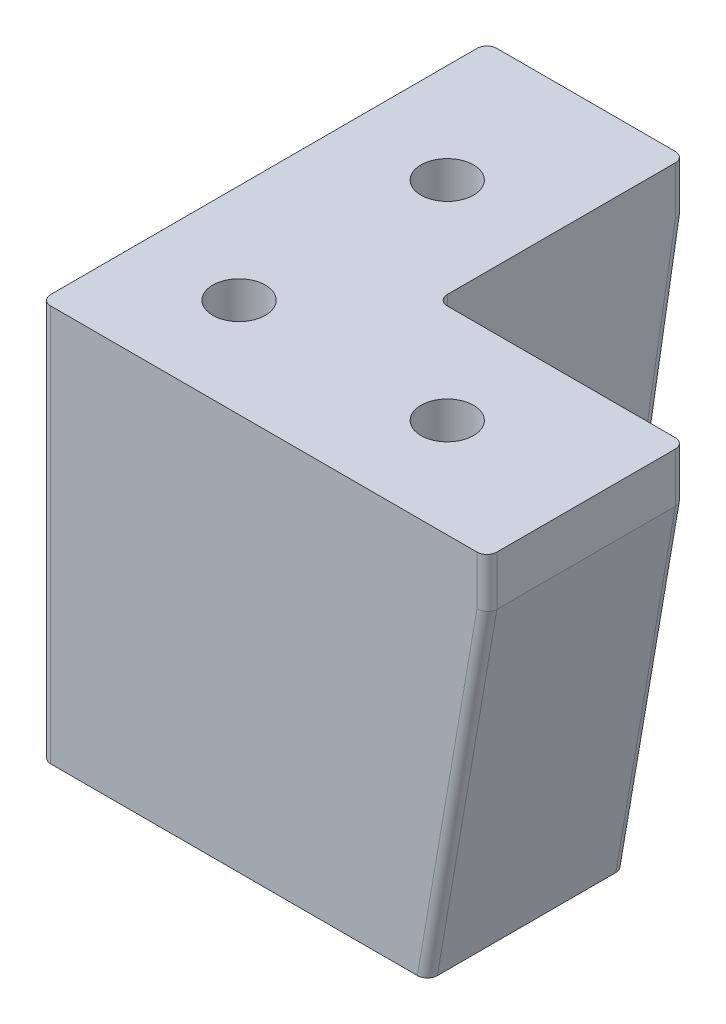
ISO-10303-21;
HEADER;
FILE_DESCRIPTION(('STEP AP214'),'2;1');
FILE_NAME('part.step','',(''),(''),'','','');
FILE_SCHEMA(('AUTOMOTIVE_DESIGN { 1 0 10303 214 1 1 1 1 }'));
ENDSEC;
DATA;
#1=APPLICATION_CONTEXT('core data for automotive mechanical design processes');
#2=APPLICATION_PROTOCOL_DEFINITION('international standard','automotive_design',2000,#1);
#3=PRODUCT_CONTEXT('',#1,'mechanical');
#4=PRODUCT('Part','Part','',(#3));
#5=PRODUCT_RELATED_PRODUCT_CATEGORY('part','',(#4));
#6=PRODUCT_DEFINITION_FORMATION('','',#4);
#7=PRODUCT_DEFINITION_CONTEXT('part definition',#1,'design');
#8=PRODUCT_DEFINITION('design','',#6,#7);
#9=PRODUCT_DEFINITION_SHAPE('','',#8);
#10=(LENGTH_UNIT() NAMED_UNIT(*) SI_UNIT(.MILLI.,.METRE.));
#11=(NAMED_UNIT(*) PLANE_ANGLE_UNIT() SI_UNIT($,.RADIAN.));
#12=(NAMED_UNIT(*) SI_UNIT($,.STERADIAN.) SOLID_ANGLE_UNIT());
#13=UNCERTAINTY_MEASURE_WITH_UNIT(LENGTH_MEASURE(1.E-05),#10,'distance_accuracy_value','');
#14=(GEOMETRIC_REPRESENTATION_CONTEXT(3) GLOBAL_UNCERTAINTY_ASSIGNED_CONTEXT((#13)) GLOBAL_UNIT_ASSIGNED_CONTEXT((#10,
#11,#12)) REPRESENTATION_CONTEXT('',''));
#15=CARTESIAN_POINT('',(0.,0.,0.));
#16=DIRECTION('',(0.,0.,1.));
#17=DIRECTION('',(1.,0.,0.));
#18=AXIS2_PLACEMENT_3D('',#15,#16,#17);
#19=CARTESIAN_POINT('',(31.,-5.,-10.));
#20=DIRECTION('',(0.,-1.,0.));
#21=DIRECTION('',(0.,0.,-1.));
#22=AXIS2_PLACEMENT_3D('',#19,#20,#21);
#23=PLANE('',#22);
#24=CARTESIAN_POINT('',(31.,-5.,-10.));
#25=DIRECTION('',(0.,-1.,0.));
#26=DIRECTION('',(0.,0.,-1.));
#27=AXIS2_PLACEMENT_3D('',#24,#25,#26);
#28=CIRCLE('',#27,5.);
#29=CARTESIAN_POINT('',(31.,-5.,-15.));
#30=VERTEX_POINT('',#29);
#31=EDGE_CURVE('E240',#30,#30,#28,.T.);
#32=ORIENTED_EDGE('',*,*,#31,.T.);
#33=EDGE_LOOP('',(#32));
#34=FACE_BOUND('',#33,.T.);
#35=CARTESIAN_POINT('',(31.,-5.,-10.));
#36=DIRECTION('',(0.,-1.,0.));
#37=DIRECTION('',(0.,0.,-1.));
#38=AXIS2_PLACEMENT_3D('',#35,#36,#37);
#39=CIRCLE('',#38,2.64999999999999);
#40=CARTESIAN_POINT('',(31.,-5.,-12.65));
#41=VERTEX_POINT('',#40);
#42=EDGE_CURVE('E274',#41,#41,#39,.F.);
#43=ORIENTED_EDGE('',*,*,#42,.T.);
#44=EDGE_LOOP('',(#43));
#45=FACE_BOUND('',#44,.T.);
#46=ADVANCED_FACE('F17',(#34,#45),#23,.T.);
#47=CARTESIAN_POINT('',(10.,-5.,-10.));
#48=DIRECTION('',(0.,-1.,0.));
#49=DIRECTION('',(0.,0.,-1.));
#50=AXIS2_PLACEMENT_3D('',#47,#48,#49);
#51=PLANE('',#50);
#52=CARTESIAN_POINT('',(10.,-5.,-10.));
#53=DIRECTION('',(0.,-1.,0.));
#54=DIRECTION('',(0.,0.,-1.));
#55=AXIS2_PLACEMENT_3D('',#52,#53,#54);
#56=CIRCLE('',#55,5.);
#57=CARTESIAN_POINT('',(10.,-5.,-15.));
#58=VERTEX_POINT('',#57);
#59=EDGE_CURVE('E267',#58,#58,#56,.T.);
#60=ORIENTED_EDGE('',*,*,#59,.T.);
#61=EDGE_LOOP('',(#60));
#62=FACE_BOUND('',#61,.T.);
#63=CARTESIAN_POINT('',(10.,-5.,-10.));
#64=DIRECTION('',(0.,-1.,0.));
#65=DIRECTION('',(0.,0.,-1.));
#66=AXIS2_PLACEMENT_3D('',#63,#64,#65);
#67=CIRCLE('',#66,2.64999999999999);
#68=CARTESIAN_POINT('',(10.,-5.,-12.65));
#69=VERTEX_POINT('',#68);
#70=EDGE_CURVE('E277',#69,#69,#67,.F.);
#71=ORIENTED_EDGE('',*,*,#70,.T.);
#72=EDGE_LOOP('',(#71));
#73=FACE_BOUND('',#72,.T.);
#74=ADVANCED_FACE('F592',(#62,#73),#51,.T.);
#75=CARTESIAN_POINT('',(10.,-5.,-31.));
#76=DIRECTION('',(0.,-1.,0.));
#77=DIRECTION('',(0.,0.,-1.));
#78=AXIS2_PLACEMENT_3D('',#75,#76,#77);
#79=PLANE('',#78);
#80=CARTESIAN_POINT('',(10.,-5.,-31.));
#81=DIRECTION('',(0.,-1.,0.));
#82=DIRECTION('',(0.,0.,-1.));
#83=AXIS2_PLACEMENT_3D('',#80,#81,#82);
#84=CIRCLE('',#83,5.);
#85=CARTESIAN_POINT('',(10.,-5.,-36.));
#86=VERTEX_POINT('',#85);
#87=EDGE_CURVE('E243',#86,#86,#84,.T.);
#88=ORIENTED_EDGE('',*,*,#87,.T.);
#89=EDGE_LOOP('',(#88));
#90=FACE_BOUND('',#89,.T.);
#91=CARTESIAN_POINT('',(10.,-5.,-31.));
#92=DIRECTION('',(0.,-1.,0.));
#93=DIRECTION('',(0.,0.,-1.));
#94=AXIS2_PLACEMENT_3D('',#91,#92,#93);
#95=CIRCLE('',#94,2.64999999999999);
#96=CARTESIAN_POINT('',(10.,-5.,-33.65));
#97=VERTEX_POINT('',#96);
#98=EDGE_CURVE('E234',#97,#97,#95,.F.);
#99=ORIENTED_EDGE('',*,*,#98,.T.);
#100=EDGE_LOOP('',(#99));
#101=FACE_BOUND('',#100,.T.);
#102=ADVANCED_FACE('F584',(#90,#101),#79,.T.);
#103=CARTESIAN_POINT('',(19.,-7.46783237838638,-43.5623555405872));
#104=DIRECTION('',(0.,-0.985622254813267,0.168963815110846));
#105=DIRECTION('',(0.,-0.168963815110846,-0.985622254813267));
#106=AXIS2_PLACEMENT_3D('',#103,#104,#105);
#107=CYLINDRICAL_SURFACE('',#106,1.);
#108=CARTESIAN_POINT('',(19.,-4.91490636514519,-44.));
#109=DIRECTION('',(0.,0.996399080392306,-0.0847872195166622));
#110=DIRECTION('',(0.,0.0847872195166613,0.996399080392306));
#111=AXIS2_PLACEMENT_3D('',#108,#109,#110);
#112=ELLIPSE('',#111,1.00361393309022,1.);
#113=CARTESIAN_POINT('',(20.,-4.91490636514526,-44.));
#114=VERTEX_POINT('',#113);
#115=CARTESIAN_POINT('',(19.,-5.00000000000005,-45.));
#116=VERTEX_POINT('',#115);
#117=EDGE_CURVE('E135',#114,#116,#112,.T.);
#118=ORIENTED_EDGE('',*,*,#117,.F.);
#119=DIRECTION('',(0.,0.985622254813267,-0.168963815110846));
#120=VECTOR('',#119,1.);
#121=CARTESIAN_POINT('',(20.,-40.,-37.9854125197392));
#122=LINE('',#121,#120);
#123=CARTESIAN_POINT('',(20.,-40.,-37.9854125197392));
#124=VERTEX_POINT('',#123);
#125=EDGE_CURVE('E133',#124,#114,#122,.T.);
#126=ORIENTED_EDGE('',*,*,#125,.F.);
#127=CARTESIAN_POINT('',(19.,-40.,-37.9854125197392));
#128=DIRECTION('',(0.,-1.,0.));
#129=DIRECTION('',(0.,0.,1.));
#130=AXIS2_PLACEMENT_3D('',#127,#128,#129);
#131=ELLIPSE('',#130,1.01458748026084,1.);
#132=CARTESIAN_POINT('',(19.,-40.,-39.));
#133=VERTEX_POINT('',#132);
#134=EDGE_CURVE('E20',#124,#133,#131,.F.);
#135=ORIENTED_EDGE('',*,*,#134,.T.);
#136=DIRECTION('',(0.,0.985622254813267,-0.168963815110846));
#137=VECTOR('',#136,1.);
#138=CARTESIAN_POINT('',(19.,-7.63679619349722,-44.5479777954005));
#139=LINE('',#138,#137);
#140=EDGE_CURVE('E130',#116,#133,#139,.F.);
#141=ORIENTED_EDGE('',*,*,#140,.F.);
#142=EDGE_LOOP('',(#118,#126,#135,#141));
#143=FACE_BOUND('',#142,.T.);
#144=ADVANCED_FACE('F129',(#143),#107,.T.);
#145=CARTESIAN_POINT('',(19.,-5.,-44.));
#146=DIRECTION('',(0.,1.,0.));
#147=DIRECTION('',(0.,0.,1.));
#148=AXIS2_PLACEMENT_3D('',#145,#146,#147);
#149=CYLINDRICAL_SURFACE('',#148,1.);
#150=CARTESIAN_POINT('',(19.,0.,-44.));
#151=DIRECTION('',(0.,1.,0.));
#152=DIRECTION('',(0.,0.,1.));
#153=AXIS2_PLACEMENT_3D('',#150,#151,#152);
#154=CIRCLE('',#153,1.);
#155=CARTESIAN_POINT('',(19.,0.,-45.));
#156=VERTEX_POINT('',#155);
#157=CARTESIAN_POINT('',(20.,0.,-44.));
#158=VERTEX_POINT('',#157);
#159=EDGE_CURVE('E297',#156,#158,#154,.F.);
#160=ORIENTED_EDGE('',*,*,#159,.T.);
#161=DIRECTION('',(0.,1.,0.));
#162=VECTOR('',#161,1.);
#163=CARTESIAN_POINT('',(20.,-5.,-44.));
#164=LINE('',#163,#162);
#165=EDGE_CURVE('E209',#114,#158,#164,.T.);
#166=ORIENTED_EDGE('',*,*,#165,.F.);
#167=ORIENTED_EDGE('',*,*,#117,.T.);
#168=DIRECTION('',(0.,1.,0.));
#169=VECTOR('',#168,1.);
#170=CARTESIAN_POINT('',(19.,-5.,-45.));
#171=LINE('',#170,#169);
#172=EDGE_CURVE('E230',#156,#116,#171,.F.);
#173=ORIENTED_EDGE('',*,*,#172,.F.);
#174=EDGE_LOOP('',(#160,#166,#167,#173));
#175=FACE_BOUND('',#174,.T.);
#176=ADVANCED_FACE('F301',(#175),#149,.T.);
#177=CARTESIAN_POINT('',(44.,-5.,-19.));
#178=DIRECTION('',(0.,1.,0.));
#179=DIRECTION('',(0.,0.,1.));
#180=AXIS2_PLACEMENT_3D('',#177,#178,#179);
#181=CYLINDRICAL_SURFACE('',#180,1.);
#182=CARTESIAN_POINT('',(44.,0.,-19.));
#183=DIRECTION('',(0.,1.,0.));
#184=DIRECTION('',(0.,0.,1.));
#185=AXIS2_PLACEMENT_3D('',#182,#183,#184);
#186=CIRCLE('',#185,1.);
#187=CARTESIAN_POINT('',(44.,0.,-20.));
#188=VERTEX_POINT('',#187);
#189=CARTESIAN_POINT('',(45.,0.,-19.));
#190=VERTEX_POINT('',#189);
#191=EDGE_CURVE('E295',#188,#190,#186,.F.);
#192=ORIENTED_EDGE('',*,*,#191,.T.);
#193=DIRECTION('',(0.,1.,0.));
#194=VECTOR('',#193,1.);
#195=CARTESIAN_POINT('',(45.,-5.,-19.));
#196=LINE('',#195,#194);
#197=CARTESIAN_POINT('',(45.,-5.00000000000007,-19.));
#198=VERTEX_POINT('',#197);
#199=EDGE_CURVE('E231',#198,#190,#196,.T.);
#200=ORIENTED_EDGE('',*,*,#199,.F.);
#201=CARTESIAN_POINT('',(44.,-4.91490636514523,-19.));
#202=DIRECTION('',(-0.0847872195166622,-0.996399080392306,0.));
#203=DIRECTION('',(-0.996399080392306,0.0847872195166613,0.));
#204=AXIS2_PLACEMENT_3D('',#201,#202,#203);
#205=ELLIPSE('',#204,1.00361393309022,1.);
#206=CARTESIAN_POINT('',(44.,-4.91490636514521,-20.));
#207=VERTEX_POINT('',#206);
#208=EDGE_CURVE('E290',#207,#198,#205,.T.);
#209=ORIENTED_EDGE('',*,*,#208,.F.);
#210=DIRECTION('',(0.,1.,0.));
#211=VECTOR('',#210,1.);
#212=CARTESIAN_POINT('',(44.,-5.,-20.));
#213=LINE('',#212,#211);
#214=EDGE_CURVE('E207',#188,#207,#213,.F.);
#215=ORIENTED_EDGE('',*,*,#214,.F.);
#216=EDGE_LOOP('',(#192,#200,#209,#215));
#217=FACE_BOUND('',#216,.T.);
#218=ADVANCED_FACE('F358',(#217),#181,.T.);
#219=CARTESIAN_POINT('',(44.0143777451868,-4.83103618488916,-19.));
#220=DIRECTION('',(-0.168963815110846,-0.985622254813267,0.));
#221=DIRECTION('',(0.985622254813267,-0.168963815110846,0.));
#222=AXIS2_PLACEMENT_3D('',#219,#220,#221);
#223=CYLINDRICAL_SURFACE('',#222,1.);
#224=ORIENTED_EDGE('',*,*,#208,.T.);
#225=DIRECTION('',(0.168963815110846,0.985622254813267,0.));
#226=VECTOR('',#225,1.);
#227=CARTESIAN_POINT('',(44.5479777954005,-7.63679619349722,-19.));
#228=LINE('',#227,#226);
#229=CARTESIAN_POINT('',(39.,-40.,-19.));
#230=VERTEX_POINT('',#229);
#231=EDGE_CURVE('E215',#230,#198,#228,.T.);
#232=ORIENTED_EDGE('',*,*,#231,.F.);
#233=CARTESIAN_POINT('',(37.9854125197392,-40.,-19.));
#234=DIRECTION('',(0.,-1.,0.));
#235=DIRECTION('',(-1.,0.,0.));
#236=AXIS2_PLACEMENT_3D('',#233,#234,#235);
#237=ELLIPSE('',#236,1.01458748026084,1.);
#238=CARTESIAN_POINT('',(37.9854125197392,-40.,-20.));
#239=VERTEX_POINT('',#238);
#240=EDGE_CURVE('E293',#230,#239,#237,.F.);
#241=ORIENTED_EDGE('',*,*,#240,.T.);
#242=DIRECTION('',(-0.168963815110846,-0.985622254813267,0.));
#243=VECTOR('',#242,1.);
#244=CARTESIAN_POINT('',(44.,-4.9149063651452,-20.));
#245=LINE('',#244,#243);
#246=EDGE_CURVE('E204',#207,#239,#245,.T.);
#247=ORIENTED_EDGE('',*,*,#246,.F.);
#248=EDGE_LOOP('',(#224,#232,#241,#247));
#249=FACE_BOUND('',#248,.T.);
#250=ADVANCED_FACE('F325',(#249),#223,.T.);
#251=CARTESIAN_POINT('',(21.,-5.,-21.));
#252=DIRECTION('',(0.,-1.,0.));
#253=DIRECTION('',(0.,0.,-1.));
#254=AXIS2_PLACEMENT_3D('',#251,#252,#253);
#255=CYLINDRICAL_SURFACE('',#254,1.);
#256=DIRECTION('',(0.,1.,0.));
#257=VECTOR('',#256,1.);
#258=CARTESIAN_POINT('',(20.,-5.,-21.));
#259=LINE('',#258,#257);
#260=CARTESIAN_POINT('',(20.,0.,-21.));
#261=VERTEX_POINT('',#260);
#262=CARTESIAN_POINT('',(20.,-40.,-21.));
#263=VERTEX_POINT('',#262);
#264=EDGE_CURVE('E143',#261,#263,#259,.F.);
#265=ORIENTED_EDGE('',*,*,#264,.F.);
#266=CARTESIAN_POINT('',(21.,0.,-21.));
#267=DIRECTION('',(0.,-1.,0.));
#268=DIRECTION('',(0.,0.,-1.));
#269=AXIS2_PLACEMENT_3D('',#266,#267,#268);
#270=CIRCLE('',#269,1.);
#271=CARTESIAN_POINT('',(21.,0.,-20.));
#272=VERTEX_POINT('',#271);
#273=EDGE_CURVE('E288',#272,#261,#270,.T.);
#274=ORIENTED_EDGE('',*,*,#273,.F.);
#275=DIRECTION('',(0.,1.,0.));
#276=VECTOR('',#275,1.);
#277=CARTESIAN_POINT('',(21.,-5.,-20.));
#278=LINE('',#277,#276);
#279=CARTESIAN_POINT('',(21.,-40.,-20.));
#280=VERTEX_POINT('',#279);
#281=EDGE_CURVE('E200',#280,#272,#278,.T.);
#282=ORIENTED_EDGE('',*,*,#281,.F.);
#283=CARTESIAN_POINT('',(21.,-40.,-21.));
#284=DIRECTION('',(0.,-1.,0.));
#285=DIRECTION('',(0.,0.,-1.));
#286=AXIS2_PLACEMENT_3D('',#283,#284,#285);
#287=CIRCLE('',#286,1.);
#288=EDGE_CURVE('E286',#263,#280,#287,.F.);
#289=ORIENTED_EDGE('',*,*,#288,.F.);
#290=EDGE_LOOP('',(#265,#274,#282,#289));
#291=FACE_BOUND('',#290,.T.);
#292=ADVANCED_FACE('F318',(#291),#255,.F.);
#293=CARTESIAN_POINT('',(43.5623555405872,-7.46783237838638,-1.));
#294=DIRECTION('',(-0.168963815110846,-0.985622254813267,0.));
#295=DIRECTION('',(0.985622254813267,-0.168963815110846,0.));
#296=AXIS2_PLACEMENT_3D('',#293,#294,#295);
#297=CYLINDRICAL_SURFACE('',#296,1.);
#298=CARTESIAN_POINT('',(44.,-4.91490636514519,-1.));
#299=DIRECTION('',(0.0847872195166622,0.996399080392306,0.));
#300=DIRECTION('',(-0.996399080392306,0.0847872195166613,0.));
#301=AXIS2_PLACEMENT_3D('',#298,#299,#300);
#302=ELLIPSE('',#301,1.00361393309022,1.);
#303=CARTESIAN_POINT('',(44.,-4.91490636514526,0.));
#304=VERTEX_POINT('',#303);
#305=CARTESIAN_POINT('',(45.,-5.00000000000005,-1.));
#306=VERTEX_POINT('',#305);
#307=EDGE_CURVE('E282',#304,#306,#302,.T.);
#308=ORIENTED_EDGE('',*,*,#307,.F.);
#309=DIRECTION('',(0.168963815110846,0.985622254813267,0.));
#310=VECTOR('',#309,1.);
#311=CARTESIAN_POINT('',(37.9854125197392,-40.,0.));
#312=LINE('',#311,#310);
#313=CARTESIAN_POINT('',(37.9854125197392,-40.,0.));
#314=VERTEX_POINT('',#313);
#315=EDGE_CURVE('E203',#314,#304,#312,.T.);
#316=ORIENTED_EDGE('',*,*,#315,.F.);
#317=CARTESIAN_POINT('',(37.9854125197392,-40.,-1.));
#318=DIRECTION('',(0.,-1.,0.));
#319=DIRECTION('',(-1.,0.,0.));
#320=AXIS2_PLACEMENT_3D('',#317,#318,#319);
#321=ELLIPSE('',#320,1.01458748026084,1.);
#322=CARTESIAN_POINT('',(39.,-40.,-1.));
#323=VERTEX_POINT('',#322);
#324=EDGE_CURVE('E284',#314,#323,#321,.F.);
#325=ORIENTED_EDGE('',*,*,#324,.T.);
#326=DIRECTION('',(0.168963815110846,0.985622254813267,0.));
#327=VECTOR('',#326,1.);
#328=CARTESIAN_POINT('',(44.5479777954005,-7.63679619349722,-1.));
#329=LINE('',#328,#327);
#330=EDGE_CURVE('E218',#306,#323,#329,.F.);
#331=ORIENTED_EDGE('',*,*,#330,.F.);
#332=EDGE_LOOP('',(#308,#316,#325,#331));
#333=FACE_BOUND('',#332,.T.);
#334=ADVANCED_FACE('F334',(#333),#297,.T.);
#335=CARTESIAN_POINT('',(44.,-5.,-1.));
#336=DIRECTION('',(0.,1.,0.));
#337=DIRECTION('',(0.,0.,1.));
#338=AXIS2_PLACEMENT_3D('',#335,#336,#337);
#339=CYLINDRICAL_SURFACE('',#338,1.);
#340=CARTESIAN_POINT('',(44.,0.,-1.));
#341=DIRECTION('',(0.,1.,0.));
#342=DIRECTION('',(0.,0.,1.));
#343=AXIS2_PLACEMENT_3D('',#340,#341,#342);
#344=CIRCLE('',#343,1.);
#345=CARTESIAN_POINT('',(45.,0.,-1.));
#346=VERTEX_POINT('',#345);
#347=CARTESIAN_POINT('',(44.,0.,0.));
#348=VERTEX_POINT('',#347);
#349=EDGE_CURVE('E280',#346,#348,#344,.F.);
#350=ORIENTED_EDGE('',*,*,#349,.T.);
#351=DIRECTION('',(0.,1.,0.));
#352=VECTOR('',#351,1.);
#353=CARTESIAN_POINT('',(44.,-5.,0.));
#354=LINE('',#353,#352);
#355=EDGE_CURVE('E214',#304,#348,#354,.T.);
#356=ORIENTED_EDGE('',*,*,#355,.F.);
#357=ORIENTED_EDGE('',*,*,#307,.T.);
#358=DIRECTION('',(0.,1.,0.));
#359=VECTOR('',#358,1.);
#360=CARTESIAN_POINT('',(45.,-5.,-1.));
#361=LINE('',#360,#359);
#362=EDGE_CURVE('E227',#346,#306,#361,.F.);
#363=ORIENTED_EDGE('',*,*,#362,.F.);
#364=EDGE_LOOP('',(#350,#356,#357,#363));
#365=FACE_BOUND('',#364,.T.);
#366=ADVANCED_FACE('F354',(#365),#339,.T.);
#367=CARTESIAN_POINT('',(10.,-5.,-10.));
#368=DIRECTION('',(0.,-1.,0.));
#369=DIRECTION('',(0.,0.,-1.));
#370=AXIS2_PLACEMENT_3D('',#367,#368,#369);
#371=CYLINDRICAL_SURFACE('',#370,2.64999999999999);
#372=CARTESIAN_POINT('',(10.,0.,-10.));
#373=DIRECTION('',(0.,-1.,0.));
#374=DIRECTION('',(0.,0.,-1.));
#375=AXIS2_PLACEMENT_3D('',#372,#373,#374);
#376=CIRCLE('',#375,2.64999999999999);
#377=CARTESIAN_POINT('',(10.,0.,-12.65));
#378=VERTEX_POINT('',#377);
#379=EDGE_CURVE('E237',#378,#378,#376,.T.);
#380=ORIENTED_EDGE('',*,*,#379,.F.);
#381=EDGE_LOOP('',(#380));
#382=FACE_BOUND('',#381,.T.);
#383=ORIENTED_EDGE('',*,*,#70,.F.);
#384=EDGE_LOOP('',(#383));
#385=FACE_BOUND('',#384,.T.);
#386=ADVANCED_FACE('F416',(#382,#385),#371,.F.);
#387=CARTESIAN_POINT('',(31.,-5.,-10.));
#388=DIRECTION('',(0.,-1.,0.));
#389=DIRECTION('',(0.,0.,-1.));
#390=AXIS2_PLACEMENT_3D('',#387,#388,#389);
#391=CYLINDRICAL_SURFACE('',#390,2.64999999999999);
#392=CARTESIAN_POINT('',(31.,0.,-10.));
#393=DIRECTION('',(0.,-1.,0.));
#394=DIRECTION('',(0.,0.,-1.));
#395=AXIS2_PLACEMENT_3D('',#392,#393,#394);
#396=CIRCLE('',#395,2.64999999999999);
#397=CARTESIAN_POINT('',(31.,0.,-12.65));
#398=VERTEX_POINT('',#397);
#399=EDGE_CURVE('E260',#398,#398,#396,.T.);
#400=ORIENTED_EDGE('',*,*,#399,.F.);
#401=EDGE_LOOP('',(#400));
#402=FACE_BOUND('',#401,.T.);
#403=ORIENTED_EDGE('',*,*,#42,.F.);
#404=EDGE_LOOP('',(#403));
#405=FACE_BOUND('',#404,.T.);
#406=ADVANCED_FACE('F412',(#402,#405),#391,.F.);
#407=CARTESIAN_POINT('',(10.,-5.,-31.));
#408=DIRECTION('',(0.,-1.,0.));
#409=DIRECTION('',(0.,0.,-1.));
#410=AXIS2_PLACEMENT_3D('',#407,#408,#409);
#411=CYLINDRICAL_SURFACE('',#410,2.64999999999999);
#412=CARTESIAN_POINT('',(10.,0.,-31.));
#413=DIRECTION('',(0.,-1.,0.));
#414=DIRECTION('',(0.,0.,-1.));
#415=AXIS2_PLACEMENT_3D('',#412,#413,#414);
#416=CIRCLE('',#415,2.64999999999999);
#417=CARTESIAN_POINT('',(10.,0.,-33.65));
#418=VERTEX_POINT('',#417);
#419=EDGE_CURVE('E196',#418,#418,#416,.T.);
#420=ORIENTED_EDGE('',*,*,#419,.F.);
#421=EDGE_LOOP('',(#420));
#422=FACE_BOUND('',#421,.T.);
#423=ORIENTED_EDGE('',*,*,#98,.F.);
#424=EDGE_LOOP('',(#423));
#425=FACE_BOUND('',#424,.T.);
#426=ADVANCED_FACE('F409',(#422,#425),#411,.F.);
#427=CARTESIAN_POINT('',(45.,-5.,0.));
#428=DIRECTION('',(1.,0.,0.));
#429=DIRECTION('',(0.,0.,-1.));
#430=AXIS2_PLACEMENT_3D('',#427,#428,#429);
#431=PLANE('',#430);
#432=DIRECTION('',(0.,0.,1.));
#433=VECTOR('',#432,1.);
#434=CARTESIAN_POINT('',(45.,0.,0.));
#435=LINE('',#434,#433);
#436=EDGE_CURVE('E188',#346,#190,#435,.F.);
#437=ORIENTED_EDGE('',*,*,#436,.F.);
#438=ORIENTED_EDGE('',*,*,#362,.T.);
#439=DIRECTION('',(0.,0.,1.));
#440=VECTOR('',#439,1.);
#441=CARTESIAN_POINT('',(45.,-5.,0.));
#442=LINE('',#441,#440);
#443=EDGE_CURVE('E221',#198,#306,#442,.T.);
#444=ORIENTED_EDGE('',*,*,#443,.F.);
#445=ORIENTED_EDGE('',*,*,#199,.T.);
#446=EDGE_LOOP('',(#437,#438,#444,#445));
#447=FACE_BOUND('',#446,.T.);
#448=ADVANCED_FACE('F356',(#447),#431,.T.);
#449=CARTESIAN_POINT('',(20.,-5.,-45.));
#450=DIRECTION('',(0.,0.,-1.));
#451=DIRECTION('',(-1.,0.,0.));
#452=AXIS2_PLACEMENT_3D('',#449,#450,#451);
#453=PLANE('',#452);
#454=DIRECTION('',(1.,0.,0.));
#455=VECTOR('',#454,1.);
#456=CARTESIAN_POINT('',(0.,0.,-45.));
#457=LINE('',#456,#455);
#458=CARTESIAN_POINT('',(1.,0.,-45.));
#459=VERTEX_POINT('',#458);
#460=EDGE_CURVE('E194',#156,#459,#457,.F.);
#461=ORIENTED_EDGE('',*,*,#460,.F.);
#462=ORIENTED_EDGE('',*,*,#172,.T.);
#463=DIRECTION('',(1.,0.,0.));
#464=VECTOR('',#463,1.);
#465=CARTESIAN_POINT('',(0.,-5.,-45.));
#466=LINE('',#465,#464);
#467=CARTESIAN_POINT('',(1.,-5.00000000000007,-45.));
#468=VERTEX_POINT('',#467);
#469=EDGE_CURVE('E142',#468,#116,#466,.T.);
#470=ORIENTED_EDGE('',*,*,#469,.F.);
#471=DIRECTION('',(0.,1.,0.));
#472=VECTOR('',#471,1.);
#473=CARTESIAN_POINT('',(1.,-5.,-45.));
#474=LINE('',#473,#472);
#475=EDGE_CURVE('E175',#459,#468,#474,.F.);
#476=ORIENTED_EDGE('',*,*,#475,.F.);
#477=EDGE_LOOP('',(#461,#462,#470,#476));
#478=FACE_BOUND('',#477,.T.);
#479=ADVANCED_FACE('F304',(#478),#453,.T.);
#480=CARTESIAN_POINT('',(31.,-5.,-10.));
#481=DIRECTION('',(0.,-1.,0.));
#482=DIRECTION('',(0.,0.,-1.));
#483=AXIS2_PLACEMENT_3D('',#480,#481,#482);
#484=CYLINDRICAL_SURFACE('',#483,5.);
#485=CARTESIAN_POINT('',(31.,-40.,-10.));
#486=DIRECTION('',(0.,-1.,0.));
#487=DIRECTION('',(0.,0.,-1.));
#488=AXIS2_PLACEMENT_3D('',#485,#486,#487);
#489=CIRCLE('',#488,5.);
#490=CARTESIAN_POINT('',(31.,-40.,-15.));
#491=VERTEX_POINT('',#490);
#492=EDGE_CURVE('E170',#491,#491,#489,.F.);
#493=ORIENTED_EDGE('',*,*,#492,.F.);
#494=EDGE_LOOP('',(#493));
#495=FACE_BOUND('',#494,.T.);
#496=ORIENTED_EDGE('',*,*,#31,.F.);
#497=EDGE_LOOP('',(#496));
#498=FACE_BOUND('',#497,.T.);
#499=ADVANCED_FACE('F400',(#495,#498),#484,.F.);
#500=CARTESIAN_POINT('',(10.,-5.,-10.));
#501=DIRECTION('',(0.,-1.,0.));
#502=DIRECTION('',(0.,0.,-1.));
#503=AXIS2_PLACEMENT_3D('',#500,#501,#502);
#504=CYLINDRICAL_SURFACE('',#503,5.);
#505=CARTESIAN_POINT('',(10.,-40.,-10.));
#506=DIRECTION('',(0.,-1.,0.));
#507=DIRECTION('',(0.,0.,-1.));
#508=AXIS2_PLACEMENT_3D('',#505,#506,#507);
#509=CIRCLE('',#508,5.);
#510=CARTESIAN_POINT('',(10.,-40.,-15.));
#511=VERTEX_POINT('',#510);
#512=EDGE_CURVE('E249',#511,#511,#509,.F.);
#513=ORIENTED_EDGE('',*,*,#512,.F.);
#514=EDGE_LOOP('',(#513));
#515=FACE_BOUND('',#514,.T.);
#516=ORIENTED_EDGE('',*,*,#59,.F.);
#517=EDGE_LOOP('',(#516));
#518=FACE_BOUND('',#517,.T.);
#519=ADVANCED_FACE('F396',(#515,#518),#504,.F.);
#520=CARTESIAN_POINT('',(10.,-5.,-31.));
#521=DIRECTION('',(0.,-1.,0.));
#522=DIRECTION('',(0.,0.,-1.));
#523=AXIS2_PLACEMENT_3D('',#520,#521,#522);
#524=CYLINDRICAL_SURFACE('',#523,5.);
#525=CARTESIAN_POINT('',(10.,-40.,-31.));
#526=DIRECTION('',(0.,-1.,0.));
#527=DIRECTION('',(0.,0.,-1.));
#528=AXIS2_PLACEMENT_3D('',#525,#526,#527);
#529=CIRCLE('',#528,5.);
#530=CARTESIAN_POINT('',(10.,-40.,-36.));
#531=VERTEX_POINT('',#530);
#532=EDGE_CURVE('E161',#531,#531,#529,.F.);
#533=ORIENTED_EDGE('',*,*,#532,.F.);
#534=EDGE_LOOP('',(#533));
#535=FACE_BOUND('',#534,.T.);
#536=ORIENTED_EDGE('',*,*,#87,.F.);
#537=EDGE_LOOP('',(#536));
#538=FACE_BOUND('',#537,.T.);
#539=ADVANCED_FACE('F393',(#535,#538),#524,.F.);
#540=CARTESIAN_POINT('',(44.5479777954005,-7.63679619349722,0.));
#541=DIRECTION('',(0.985622254813267,-0.168963815110846,0.));
#542=DIRECTION('',(0.168963815110846,0.985622254813267,0.));
#543=AXIS2_PLACEMENT_3D('',#540,#541,#542);
#544=PLANE('',#543);
#545=DIRECTION('',(0.,0.,-1.));
#546=VECTOR('',#545,1.);
#547=CARTESIAN_POINT('',(39.,-40.,0.));
#548=LINE('',#547,#546);
#549=EDGE_CURVE('E158',#230,#323,#548,.F.);
#550=ORIENTED_EDGE('',*,*,#549,.F.);
#551=ORIENTED_EDGE('',*,*,#231,.T.);
#552=ORIENTED_EDGE('',*,*,#443,.T.);
#553=ORIENTED_EDGE('',*,*,#330,.T.);
#554=EDGE_LOOP('',(#550,#551,#552,#553));
#555=FACE_BOUND('',#554,.T.);
#556=ADVANCED_FACE('F330',(#555),#544,.T.);
#557=CARTESIAN_POINT('',(0.,-7.63679619349722,-44.5479777954005));
#558=DIRECTION('',(0.,-0.168963815110846,-0.985622254813267));
#559=DIRECTION('',(0.,0.985622254813267,-0.168963815110846));
#560=AXIS2_PLACEMENT_3D('',#557,#558,#559);
#561=PLANE('',#560);
#562=DIRECTION('',(1.,0.,0.));
#563=VECTOR('',#562,1.);
#564=CARTESIAN_POINT('',(0.,-40.,-39.));
#565=LINE('',#564,#563);
#566=CARTESIAN_POINT('',(1.,-40.,-39.));
#567=VERTEX_POINT('',#566);
#568=EDGE_CURVE('E140',#567,#133,#565,.T.);
#569=ORIENTED_EDGE('',*,*,#568,.F.);
#570=DIRECTION('',(0.,-0.985622254813267,0.168963815110846));
#571=VECTOR('',#570,1.);
#572=CARTESIAN_POINT('',(1.,-5.,-45.));
#573=LINE('',#572,#571);
#574=EDGE_CURVE('E168',#468,#567,#573,.T.);
#575=ORIENTED_EDGE('',*,*,#574,.F.);
#576=ORIENTED_EDGE('',*,*,#469,.T.);
#577=ORIENTED_EDGE('',*,*,#140,.T.);
#578=EDGE_LOOP('',(#569,#575,#576,#577));
#579=FACE_BOUND('',#578,.T.);
#580=ADVANCED_FACE('F138',(#579),#561,.T.);
#581=CARTESIAN_POINT('',(20.,-5.,-20.));
#582=DIRECTION('',(1.,0.,0.));
#583=DIRECTION('',(0.,0.,-1.));
#584=AXIS2_PLACEMENT_3D('',#581,#582,#583);
#585=PLANE('',#584);
#586=ORIENTED_EDGE('',*,*,#125,.T.);
#587=ORIENTED_EDGE('',*,*,#165,.T.);
#588=DIRECTION('',(0.,0.,1.));
#589=VECTOR('',#588,1.);
#590=CARTESIAN_POINT('',(20.,0.,0.));
#591=LINE('',#590,#589);
#592=EDGE_CURVE('E182',#261,#158,#591,.F.);
#593=ORIENTED_EDGE('',*,*,#592,.F.);
#594=ORIENTED_EDGE('',*,*,#264,.T.);
#595=DIRECTION('',(0.,0.,-1.));
#596=VECTOR('',#595,1.);
#597=CARTESIAN_POINT('',(20.,-40.,0.));
#598=LINE('',#597,#596);
#599=EDGE_CURVE('E149',#124,#263,#598,.F.);
#600=ORIENTED_EDGE('',*,*,#599,.F.);
#601=EDGE_LOOP('',(#586,#587,#593,#594,#600));
#602=FACE_BOUND('',#601,.T.);
#603=ADVANCED_FACE('F313',(#602),#585,.T.);
#604=CARTESIAN_POINT('',(45.,-5.,-20.));
#605=DIRECTION('',(0.,0.,-1.));
#606=DIRECTION('',(-1.,0.,0.));
#607=AXIS2_PLACEMENT_3D('',#604,#605,#606);
#608=PLANE('',#607);
#609=DIRECTION('',(1.,0.,0.));
#610=VECTOR('',#609,1.);
#611=CARTESIAN_POINT('',(0.,-40.,-20.));
#612=LINE('',#611,#610);
#613=EDGE_CURVE('E151',#280,#239,#612,.T.);
#614=ORIENTED_EDGE('',*,*,#613,.F.);
#615=ORIENTED_EDGE('',*,*,#281,.T.);
#616=DIRECTION('',(1.,0.,0.));
#617=VECTOR('',#616,1.);
#618=CARTESIAN_POINT('',(0.,0.,-20.));
#619=LINE('',#618,#617);
#620=EDGE_CURVE('E185',#188,#272,#619,.F.);
#621=ORIENTED_EDGE('',*,*,#620,.F.);
#622=ORIENTED_EDGE('',*,*,#214,.T.);
#623=ORIENTED_EDGE('',*,*,#246,.T.);
#624=EDGE_LOOP('',(#614,#615,#621,#622,#623));
#625=FACE_BOUND('',#624,.T.);
#626=ADVANCED_FACE('F321',(#625),#608,.T.);
#627=CARTESIAN_POINT('',(0.,-5.,0.));
#628=DIRECTION('',(0.,0.,1.));
#629=DIRECTION('',(1.,0.,0.));
#630=AXIS2_PLACEMENT_3D('',#627,#628,#629);
#631=PLANE('',#630);
#632=DIRECTION('',(0.,1.,0.));
#633=VECTOR('',#632,1.);
#634=CARTESIAN_POINT('',(1.,-5.,0.));
#635=LINE('',#634,#633);
#636=CARTESIAN_POINT('',(1.,-40.,0.));
#637=VERTEX_POINT('',#636);
#638=CARTESIAN_POINT('',(1.,0.,0.));
#639=VERTEX_POINT('',#638);
#640=EDGE_CURVE('E197',#637,#639,#635,.T.);
#641=ORIENTED_EDGE('',*,*,#640,.F.);
#642=DIRECTION('',(1.,0.,0.));
#643=VECTOR('',#642,1.);
#644=CARTESIAN_POINT('',(0.,-40.,0.));
#645=LINE('',#644,#643);
#646=EDGE_CURVE('E153',#314,#637,#645,.F.);
#647=ORIENTED_EDGE('',*,*,#646,.F.);
#648=ORIENTED_EDGE('',*,*,#315,.T.);
#649=ORIENTED_EDGE('',*,*,#355,.T.);
#650=DIRECTION('',(1.,0.,0.));
#651=VECTOR('',#650,1.);
#652=CARTESIAN_POINT('',(0.,0.,0.));
#653=LINE('',#652,#651);
#654=EDGE_CURVE('E191',#639,#348,#653,.T.);
#655=ORIENTED_EDGE('',*,*,#654,.F.);
#656=EDGE_LOOP('',(#641,#647,#648,#649,#655));
#657=FACE_BOUND('',#656,.T.);
#658=ADVANCED_FACE('F339',(#657),#631,.T.);
#659=CARTESIAN_POINT('',(0.,0.,0.));
#660=DIRECTION('',(0.,1.,0.));
#661=DIRECTION('',(0.,0.,1.));
#662=AXIS2_PLACEMENT_3D('',#659,#660,#661);
#663=PLANE('',#662);
#664=ORIENTED_EDGE('',*,*,#592,.T.);
#665=ORIENTED_EDGE('',*,*,#159,.F.);
#666=ORIENTED_EDGE('',*,*,#460,.T.);
#667=CARTESIAN_POINT('',(1.,0.,-44.));
#668=DIRECTION('',(0.,1.,0.));
#669=DIRECTION('',(0.,0.,1.));
#670=AXIS2_PLACEMENT_3D('',#667,#668,#669);
#671=CIRCLE('',#670,1.);
#672=CARTESIAN_POINT('',(0.,0.,-44.));
#673=VERTEX_POINT('',#672);
#674=EDGE_CURVE('E178',#673,#459,#671,.F.);
#675=ORIENTED_EDGE('',*,*,#674,.F.);
#676=DIRECTION('',(0.,0.,1.));
#677=VECTOR('',#676,1.);
#678=CARTESIAN_POINT('',(0.,0.,-45.));
#679=LINE('',#678,#677);
#680=CARTESIAN_POINT('',(0.,0.,-1.));
#681=VERTEX_POINT('',#680);
#682=EDGE_CURVE('E174',#681,#673,#679,.F.);
#683=ORIENTED_EDGE('',*,*,#682,.F.);
#684=CARTESIAN_POINT('',(1.,0.,-1.));
#685=DIRECTION('',(0.,1.,0.));
#686=DIRECTION('',(0.,0.,1.));
#687=AXIS2_PLACEMENT_3D('',#684,#685,#686);
#688=CIRCLE('',#687,1.);
#689=EDGE_CURVE('E181',#639,#681,#688,.F.);
#690=ORIENTED_EDGE('',*,*,#689,.F.);
#691=ORIENTED_EDGE('',*,*,#654,.T.);
#692=ORIENTED_EDGE('',*,*,#349,.F.);
#693=ORIENTED_EDGE('',*,*,#436,.T.);
#694=ORIENTED_EDGE('',*,*,#191,.F.);
#695=ORIENTED_EDGE('',*,*,#620,.T.);
#696=ORIENTED_EDGE('',*,*,#273,.T.);
#697=EDGE_LOOP('',(#664,#665,#666,#675,#683,#690,#691,#692,#693,#694,#695,#696));
#698=FACE_BOUND('',#697,.T.);
#699=ORIENTED_EDGE('',*,*,#419,.T.);
#700=EDGE_LOOP('',(#699));
#701=FACE_BOUND('',#700,.T.);
#702=ORIENTED_EDGE('',*,*,#399,.T.);
#703=EDGE_LOOP('',(#702));
#704=FACE_BOUND('',#703,.T.);
#705=ORIENTED_EDGE('',*,*,#379,.T.);
#706=EDGE_LOOP('',(#705));
#707=FACE_BOUND('',#706,.T.);
#708=ADVANCED_FACE('F307',(#698,#701,#704,#707),#663,.T.);
#709=CARTESIAN_POINT('',(1.,-5.,-44.));
#710=DIRECTION('',(0.,1.,0.));
#711=DIRECTION('',(0.,0.,1.));
#712=AXIS2_PLACEMENT_3D('',#709,#710,#711);
#713=CYLINDRICAL_SURFACE('',#712,1.);
#714=ORIENTED_EDGE('',*,*,#674,.T.);
#715=ORIENTED_EDGE('',*,*,#475,.T.);
#716=CARTESIAN_POINT('',(1.,-4.91490636514523,-44.));
#717=DIRECTION('',(0.,-0.996399080392306,0.0847872195166622));
#718=DIRECTION('',(0.,0.0847872195166613,0.996399080392306));
#719=AXIS2_PLACEMENT_3D('',#716,#717,#718);
#720=ELLIPSE('',#719,1.00361393309022,1.);
#721=CARTESIAN_POINT('',(0.,-4.91490636514521,-44.));
#722=VERTEX_POINT('',#721);
#723=EDGE_CURVE('E171',#722,#468,#720,.T.);
#724=ORIENTED_EDGE('',*,*,#723,.F.);
#725=DIRECTION('',(0.,1.,0.));
#726=VECTOR('',#725,1.);
#727=CARTESIAN_POINT('',(0.,-5.,-44.));
#728=LINE('',#727,#726);
#729=EDGE_CURVE('E165',#673,#722,#728,.F.);
#730=ORIENTED_EDGE('',*,*,#729,.F.);
#731=EDGE_LOOP('',(#714,#715,#724,#730));
#732=FACE_BOUND('',#731,.T.);
#733=ADVANCED_FACE('F350',(#732),#713,.T.);
#734=CARTESIAN_POINT('',(1.,-4.83103618488916,-44.0143777451868));
#735=DIRECTION('',(0.,-0.985622254813267,0.168963815110846));
#736=DIRECTION('',(0.,-0.168963815110846,-0.985622254813267));
#737=AXIS2_PLACEMENT_3D('',#734,#735,#736);
#738=CYLINDRICAL_SURFACE('',#737,1.);
#739=ORIENTED_EDGE('',*,*,#723,.T.);
#740=ORIENTED_EDGE('',*,*,#574,.T.);
#741=CARTESIAN_POINT('',(1.,-40.,-37.9854125197392));
#742=DIRECTION('',(0.,-1.,0.));
#743=DIRECTION('',(0.,0.,1.));
#744=AXIS2_PLACEMENT_3D('',#741,#742,#743);
#745=ELLIPSE('',#744,1.01458748026084,1.);
#746=CARTESIAN_POINT('',(0.,-40.,-37.9854125197392));
#747=VERTEX_POINT('',#746);
#748=EDGE_CURVE('E148',#747,#567,#745,.T.);
#749=ORIENTED_EDGE('',*,*,#748,.F.);
#750=DIRECTION('',(0.,-0.985622254813267,0.168963815110846));
#751=VECTOR('',#750,1.);
#752=CARTESIAN_POINT('',(0.,-4.9149063651452,-44.));
#753=LINE('',#752,#751);
#754=EDGE_CURVE('E162',#722,#747,#753,.T.);
#755=ORIENTED_EDGE('',*,*,#754,.F.);
#756=EDGE_LOOP('',(#739,#740,#749,#755));
#757=FACE_BOUND('',#756,.T.);
#758=ADVANCED_FACE('F348',(#757),#738,.T.);
#759=CARTESIAN_POINT('',(0.,-40.,0.));
#760=DIRECTION('',(0.,-1.,0.));
#761=DIRECTION('',(0.,0.,-1.));
#762=AXIS2_PLACEMENT_3D('',#759,#760,#761);
#763=PLANE('',#762);
#764=ORIENTED_EDGE('',*,*,#613,.T.);
#765=ORIENTED_EDGE('',*,*,#240,.F.);
#766=ORIENTED_EDGE('',*,*,#549,.T.);
#767=ORIENTED_EDGE('',*,*,#324,.F.);
#768=ORIENTED_EDGE('',*,*,#646,.T.);
#769=CARTESIAN_POINT('',(1.,-40.,-1.));
#770=DIRECTION('',(0.,1.,0.));
#771=DIRECTION('',(0.,0.,1.));
#772=AXIS2_PLACEMENT_3D('',#769,#770,#771);
#773=CIRCLE('',#772,1.);
#774=CARTESIAN_POINT('',(0.,-40.,-1.));
#775=VERTEX_POINT('',#774);
#776=EDGE_CURVE('E35',#775,#637,#773,.T.);
#777=ORIENTED_EDGE('',*,*,#776,.F.);
#778=DIRECTION('',(0.,0.,1.));
#779=VECTOR('',#778,1.);
#780=CARTESIAN_POINT('',(0.,-40.,-45.));
#781=LINE('',#780,#779);
#782=EDGE_CURVE('E26',#747,#775,#781,.T.);
#783=ORIENTED_EDGE('',*,*,#782,.F.);
#784=ORIENTED_EDGE('',*,*,#748,.T.);
#785=ORIENTED_EDGE('',*,*,#568,.T.);
#786=ORIENTED_EDGE('',*,*,#134,.F.);
#787=ORIENTED_EDGE('',*,*,#599,.T.);
#788=ORIENTED_EDGE('',*,*,#288,.T.);
#789=EDGE_LOOP('',(#764,#765,#766,#767,#768,#777,#783,#784,#785,#786,#787,#788));
#790=FACE_BOUND('',#789,.T.);
#791=ORIENTED_EDGE('',*,*,#532,.T.);
#792=EDGE_LOOP('',(#791));
#793=FACE_BOUND('',#792,.T.);
#794=ORIENTED_EDGE('',*,*,#512,.T.);
#795=EDGE_LOOP('',(#794));
#796=FACE_BOUND('',#795,.T.);
#797=ORIENTED_EDGE('',*,*,#492,.T.);
#798=EDGE_LOOP('',(#797));
#799=FACE_BOUND('',#798,.T.);
#800=ADVANCED_FACE('F146',(#790,#793,#796,#799),#763,.T.);
#801=CARTESIAN_POINT('',(1.,-5.,-1.));
#802=DIRECTION('',(0.,1.,0.));
#803=DIRECTION('',(0.,0.,1.));
#804=AXIS2_PLACEMENT_3D('',#801,#802,#803);
#805=CYLINDRICAL_SURFACE('',#804,1.);
#806=ORIENTED_EDGE('',*,*,#689,.T.);
#807=DIRECTION('',(0.,1.,0.));
#808=VECTOR('',#807,1.);
#809=CARTESIAN_POINT('',(0.,-5.,-1.));
#810=LINE('',#809,#808);
#811=EDGE_CURVE('E11',#775,#681,#810,.T.);
#812=ORIENTED_EDGE('',*,*,#811,.F.);
#813=ORIENTED_EDGE('',*,*,#776,.T.);
#814=ORIENTED_EDGE('',*,*,#640,.T.);
#815=EDGE_LOOP('',(#806,#812,#813,#814));
#816=FACE_BOUND('',#815,.T.);
#817=ADVANCED_FACE('F343',(#816),#805,.T.);
#818=CARTESIAN_POINT('',(0.,-5.,-45.));
#819=DIRECTION('',(-1.,0.,0.));
#820=DIRECTION('',(0.,0.,1.));
#821=AXIS2_PLACEMENT_3D('',#818,#819,#820);
#822=PLANE('',#821);
#823=ORIENTED_EDGE('',*,*,#782,.T.);
#824=ORIENTED_EDGE('',*,*,#811,.T.);
#825=ORIENTED_EDGE('',*,*,#682,.T.);
#826=ORIENTED_EDGE('',*,*,#729,.T.);
#827=ORIENTED_EDGE('',*,*,#754,.T.);
#828=EDGE_LOOP('',(#823,#824,#825,#826,#827));
#829=FACE_BOUND('',#828,.T.);
#830=ADVANCED_FACE('F345',(#829),#822,.T.);
#831=CLOSED_SHELL('',(#46,#74,#102,#144,#176,#218,#250,#292,#334,#366,#386,#406,#426,#448,#479,
#499,#519,#539,#556,#580,#603,#626,#658,#708,#733,#758,#800,#817,#830));
#832=MANIFOLD_SOLID_BREP('B1',#831);
#833=ADVANCED_BREP_SHAPE_REPRESENTATION('',(#18,#832),#14);
#834=SHAPE_DEFINITION_REPRESENTATION(#9,#833);
ENDSEC;
END-ISO-10303-21;
